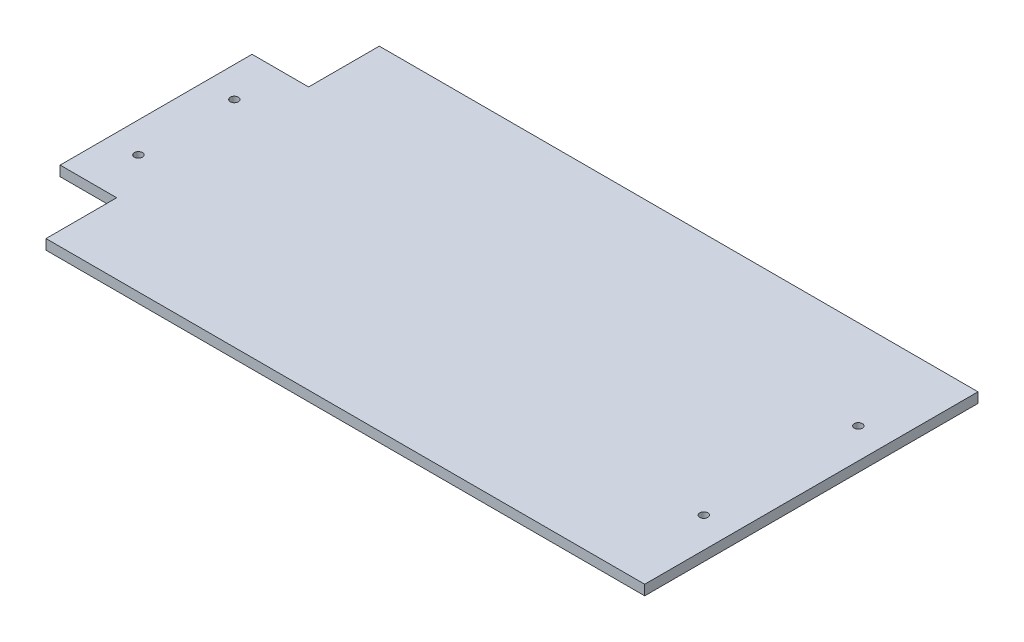
ISO-10303-21;
HEADER;
FILE_DESCRIPTION(('STEP AP214'),'2;1');
FILE_NAME('part.step','',(''),(''),'','','');
FILE_SCHEMA(('AUTOMOTIVE_DESIGN { 1 0 10303 214 1 1 1 1 }'));
ENDSEC;
DATA;
#1=APPLICATION_CONTEXT('core data for automotive mechanical design processes');
#2=APPLICATION_PROTOCOL_DEFINITION('international standard','automotive_design',2000,#1);
#3=PRODUCT_CONTEXT('',#1,'mechanical');
#4=PRODUCT('Part','Part','',(#3));
#5=PRODUCT_RELATED_PRODUCT_CATEGORY('part','',(#4));
#6=PRODUCT_DEFINITION_FORMATION('','',#4);
#7=PRODUCT_DEFINITION_CONTEXT('part definition',#1,'design');
#8=PRODUCT_DEFINITION('design','',#6,#7);
#9=PRODUCT_DEFINITION_SHAPE('','',#8);
#10=(LENGTH_UNIT() NAMED_UNIT(*) SI_UNIT(.MILLI.,.METRE.));
#11=(NAMED_UNIT(*) PLANE_ANGLE_UNIT() SI_UNIT($,.RADIAN.));
#12=(NAMED_UNIT(*) SI_UNIT($,.STERADIAN.) SOLID_ANGLE_UNIT());
#13=UNCERTAINTY_MEASURE_WITH_UNIT(LENGTH_MEASURE(1.E-05),#10,'distance_accuracy_value','');
#14=(GEOMETRIC_REPRESENTATION_CONTEXT(3) GLOBAL_UNCERTAINTY_ASSIGNED_CONTEXT((#13)) GLOBAL_UNIT_ASSIGNED_CONTEXT((#10,
#11,#12)) REPRESENTATION_CONTEXT('',''));
#15=CARTESIAN_POINT('',(0.,0.,0.));
#16=DIRECTION('',(0.,0.,1.));
#17=DIRECTION('',(1.,0.,0.));
#18=AXIS2_PLACEMENT_3D('',#15,#16,#17);
#19=CARTESIAN_POINT('',(162.2,5.,-82.5000000000001));
#20=DIRECTION('',(0.,0.,1.));
#21=DIRECTION('',(1.,0.,0.));
#22=AXIS2_PLACEMENT_3D('',#19,#20,#21);
#23=PLANE('',#22);
#24=DIRECTION('',(-1.,0.,0.));
#25=VECTOR('',#24,1.);
#26=CARTESIAN_POINT('',(162.2,0.,-82.5000000000001));
#27=LINE('',#26,#25);
#28=CARTESIAN_POINT('',(162.2,0.,-82.5000000000001));
#29=VERTEX_POINT('',#28);
#30=CARTESIAN_POINT('',(-134.2,0.,-82.5));
#31=VERTEX_POINT('',#30);
#32=EDGE_CURVE('E148',#29,#31,#27,.T.);
#33=ORIENTED_EDGE('',*,*,#32,.T.);
#34=DIRECTION('',(0.,-1.,0.));
#35=VECTOR('',#34,1.);
#36=CARTESIAN_POINT('',(-134.2,5.,-82.5));
#37=LINE('',#36,#35);
#38=CARTESIAN_POINT('',(-134.2,5.,-82.5));
#39=VERTEX_POINT('',#38);
#40=EDGE_CURVE('E11',#39,#31,#37,.T.);
#41=ORIENTED_EDGE('',*,*,#40,.F.);
#42=DIRECTION('',(-1.,0.,0.));
#43=VECTOR('',#42,1.);
#44=CARTESIAN_POINT('',(162.2,5.,-82.5000000000001));
#45=LINE('',#44,#43);
#46=CARTESIAN_POINT('',(162.2,5.,-82.5000000000001));
#47=VERTEX_POINT('',#46);
#48=EDGE_CURVE('E171',#47,#39,#45,.T.);
#49=ORIENTED_EDGE('',*,*,#48,.F.);
#50=DIRECTION('',(0.,-1.,0.));
#51=VECTOR('',#50,1.);
#52=CARTESIAN_POINT('',(162.2,5.,-82.5000000000001));
#53=LINE('',#52,#51);
#54=EDGE_CURVE('E144',#47,#29,#53,.T.);
#55=ORIENTED_EDGE('',*,*,#54,.T.);
#56=EDGE_LOOP('',(#33,#41,#49,#55));
#57=FACE_BOUND('',#56,.T.);
#58=ADVANCED_FACE('F47',(#57),#23,.F.);
#59=CARTESIAN_POINT('',(-134.2,5.,-47.5));
#60=DIRECTION('',(1.,0.,0.));
#61=DIRECTION('',(0.,0.,-1.));
#62=AXIS2_PLACEMENT_3D('',#59,#60,#61);
#63=PLANE('',#62);
#64=DIRECTION('',(0.,0.,1.));
#65=VECTOR('',#64,1.);
#66=CARTESIAN_POINT('',(-134.2,0.,-47.5));
#67=LINE('',#66,#65);
#68=CARTESIAN_POINT('',(-134.2,0.,-47.5));
#69=VERTEX_POINT('',#68);
#70=EDGE_CURVE('E152',#31,#69,#67,.T.);
#71=ORIENTED_EDGE('',*,*,#70,.T.);
#72=DIRECTION('',(0.,-1.,0.));
#73=VECTOR('',#72,1.);
#74=CARTESIAN_POINT('',(-134.2,5.,-47.5));
#75=LINE('',#74,#73);
#76=CARTESIAN_POINT('',(-134.2,5.,-47.5));
#77=VERTEX_POINT('',#76);
#78=EDGE_CURVE('E56',#77,#69,#75,.T.);
#79=ORIENTED_EDGE('',*,*,#78,.F.);
#80=DIRECTION('',(0.,0.,1.));
#81=VECTOR('',#80,1.);
#82=CARTESIAN_POINT('',(-134.2,5.,-47.5));
#83=LINE('',#82,#81);
#84=EDGE_CURVE('E107',#39,#77,#83,.T.);
#85=ORIENTED_EDGE('',*,*,#84,.F.);
#86=ORIENTED_EDGE('',*,*,#40,.T.);
#87=EDGE_LOOP('',(#71,#79,#85,#86));
#88=FACE_BOUND('',#87,.T.);
#89=ADVANCED_FACE('F272',(#88),#63,.F.);
#90=CARTESIAN_POINT('',(-162.2,5.,-47.5));
#91=DIRECTION('',(0.,0.,1.));
#92=DIRECTION('',(1.,0.,0.));
#93=AXIS2_PLACEMENT_3D('',#90,#91,#92);
#94=PLANE('',#93);
#95=DIRECTION('',(-1.,0.,0.));
#96=VECTOR('',#95,1.);
#97=CARTESIAN_POINT('',(-162.2,0.,-47.5));
#98=LINE('',#97,#96);
#99=CARTESIAN_POINT('',(-162.2,0.,-47.5));
#100=VERTEX_POINT('',#99);
#101=EDGE_CURVE('E156',#69,#100,#98,.T.);
#102=ORIENTED_EDGE('',*,*,#101,.T.);
#103=DIRECTION('',(0.,-1.,0.));
#104=VECTOR('',#103,1.);
#105=CARTESIAN_POINT('',(-162.2,5.,-47.5));
#106=LINE('',#105,#104);
#107=CARTESIAN_POINT('',(-162.2,5.,-47.5));
#108=VERTEX_POINT('',#107);
#109=EDGE_CURVE('E182',#108,#100,#106,.T.);
#110=ORIENTED_EDGE('',*,*,#109,.F.);
#111=DIRECTION('',(-1.,0.,0.));
#112=VECTOR('',#111,1.);
#113=CARTESIAN_POINT('',(-162.2,5.,-47.5));
#114=LINE('',#113,#112);
#115=EDGE_CURVE('E192',#77,#108,#114,.T.);
#116=ORIENTED_EDGE('',*,*,#115,.F.);
#117=ORIENTED_EDGE('',*,*,#78,.T.);
#118=EDGE_LOOP('',(#102,#110,#116,#117));
#119=FACE_BOUND('',#118,.T.);
#120=ADVANCED_FACE('F190',(#119),#94,.F.);
#121=CARTESIAN_POINT('',(-162.2,5.,-47.5));
#122=DIRECTION('',(1.,0.,0.));
#123=DIRECTION('',(0.,0.,-1.));
#124=AXIS2_PLACEMENT_3D('',#121,#122,#123);
#125=PLANE('',#124);
#126=DIRECTION('',(0.,0.,1.));
#127=VECTOR('',#126,1.);
#128=CARTESIAN_POINT('',(-162.2,0.,-47.5));
#129=LINE('',#128,#127);
#130=CARTESIAN_POINT('',(-162.2,0.,47.5));
#131=VERTEX_POINT('',#130);
#132=EDGE_CURVE('E159',#100,#131,#129,.T.);
#133=ORIENTED_EDGE('',*,*,#132,.T.);
#134=DIRECTION('',(0.,-1.,0.));
#135=VECTOR('',#134,1.);
#136=CARTESIAN_POINT('',(-162.2,5.,47.5));
#137=LINE('',#136,#135);
#138=CARTESIAN_POINT('',(-162.2,5.,47.5));
#139=VERTEX_POINT('',#138);
#140=EDGE_CURVE('E178',#139,#131,#137,.T.);
#141=ORIENTED_EDGE('',*,*,#140,.F.);
#142=DIRECTION('',(0.,0.,1.));
#143=VECTOR('',#142,1.);
#144=CARTESIAN_POINT('',(-162.2,5.,-47.5));
#145=LINE('',#144,#143);
#146=EDGE_CURVE('E205',#108,#139,#145,.T.);
#147=ORIENTED_EDGE('',*,*,#146,.F.);
#148=ORIENTED_EDGE('',*,*,#109,.T.);
#149=EDGE_LOOP('',(#133,#141,#147,#148));
#150=FACE_BOUND('',#149,.T.);
#151=ADVANCED_FACE('F200',(#150),#125,.F.);
#152=CARTESIAN_POINT('',(-162.2,5.,47.5));
#153=DIRECTION('',(0.,0.,-1.));
#154=DIRECTION('',(-1.,0.,0.));
#155=AXIS2_PLACEMENT_3D('',#152,#153,#154);
#156=PLANE('',#155);
#157=DIRECTION('',(1.,0.,0.));
#158=VECTOR('',#157,1.);
#159=CARTESIAN_POINT('',(-162.2,0.,47.5));
#160=LINE('',#159,#158);
#161=CARTESIAN_POINT('',(-134.2,0.,47.5));
#162=VERTEX_POINT('',#161);
#163=EDGE_CURVE('E162',#131,#162,#160,.T.);
#164=ORIENTED_EDGE('',*,*,#163,.T.);
#165=DIRECTION('',(0.,-1.,0.));
#166=VECTOR('',#165,1.);
#167=CARTESIAN_POINT('',(-134.2,5.,47.5));
#168=LINE('',#167,#166);
#169=CARTESIAN_POINT('',(-134.2,5.,47.5));
#170=VERTEX_POINT('',#169);
#171=EDGE_CURVE('E137',#170,#162,#168,.T.);
#172=ORIENTED_EDGE('',*,*,#171,.F.);
#173=DIRECTION('',(1.,0.,0.));
#174=VECTOR('',#173,1.);
#175=CARTESIAN_POINT('',(-162.2,5.,47.5));
#176=LINE('',#175,#174);
#177=EDGE_CURVE('E126',#139,#170,#176,.T.);
#178=ORIENTED_EDGE('',*,*,#177,.F.);
#179=ORIENTED_EDGE('',*,*,#140,.T.);
#180=EDGE_LOOP('',(#164,#172,#178,#179));
#181=FACE_BOUND('',#180,.T.);
#182=ADVANCED_FACE('F203',(#181),#156,.F.);
#183=CARTESIAN_POINT('',(-134.2,5.,47.5));
#184=DIRECTION('',(1.,0.,0.));
#185=DIRECTION('',(0.,0.,-1.));
#186=AXIS2_PLACEMENT_3D('',#183,#184,#185);
#187=PLANE('',#186);
#188=DIRECTION('',(0.,0.,1.));
#189=VECTOR('',#188,1.);
#190=CARTESIAN_POINT('',(-134.2,0.,47.5));
#191=LINE('',#190,#189);
#192=CARTESIAN_POINT('',(-134.2,0.,82.5));
#193=VERTEX_POINT('',#192);
#194=EDGE_CURVE('E135',#162,#193,#191,.T.);
#195=ORIENTED_EDGE('',*,*,#194,.T.);
#196=DIRECTION('',(0.,-1.,0.));
#197=VECTOR('',#196,1.);
#198=CARTESIAN_POINT('',(-134.2,5.,82.5));
#199=LINE('',#198,#197);
#200=CARTESIAN_POINT('',(-134.2,5.,82.5));
#201=VERTEX_POINT('',#200);
#202=EDGE_CURVE('E132',#201,#193,#199,.T.);
#203=ORIENTED_EDGE('',*,*,#202,.F.);
#204=DIRECTION('',(0.,0.,1.));
#205=VECTOR('',#204,1.);
#206=CARTESIAN_POINT('',(-134.2,5.,47.5));
#207=LINE('',#206,#205);
#208=EDGE_CURVE('E120',#170,#201,#207,.T.);
#209=ORIENTED_EDGE('',*,*,#208,.F.);
#210=ORIENTED_EDGE('',*,*,#171,.T.);
#211=EDGE_LOOP('',(#195,#203,#209,#210));
#212=FACE_BOUND('',#211,.T.);
#213=ADVANCED_FACE('F133',(#212),#187,.F.);
#214=CARTESIAN_POINT('',(162.2,5.,82.5000000000001));
#215=DIRECTION('',(0.,0.,-1.));
#216=DIRECTION('',(-1.,0.,0.));
#217=AXIS2_PLACEMENT_3D('',#214,#215,#216);
#218=PLANE('',#217);
#219=DIRECTION('',(1.,0.,0.));
#220=VECTOR('',#219,1.);
#221=CARTESIAN_POINT('',(162.2,0.,82.5000000000001));
#222=LINE('',#221,#220);
#223=CARTESIAN_POINT('',(162.2,0.,82.5000000000001));
#224=VERTEX_POINT('',#223);
#225=EDGE_CURVE('E93',#193,#224,#222,.T.);
#226=ORIENTED_EDGE('',*,*,#225,.T.);
#227=DIRECTION('',(0.,-1.,0.));
#228=VECTOR('',#227,1.);
#229=CARTESIAN_POINT('',(162.2,5.,82.5000000000001));
#230=LINE('',#229,#228);
#231=CARTESIAN_POINT('',(162.2,5.,82.5000000000001));
#232=VERTEX_POINT('',#231);
#233=EDGE_CURVE('E138',#232,#224,#230,.T.);
#234=ORIENTED_EDGE('',*,*,#233,.F.);
#235=DIRECTION('',(1.,0.,0.));
#236=VECTOR('',#235,1.);
#237=CARTESIAN_POINT('',(162.2,5.,82.5000000000001));
#238=LINE('',#237,#236);
#239=EDGE_CURVE('E124',#201,#232,#238,.T.);
#240=ORIENTED_EDGE('',*,*,#239,.F.);
#241=ORIENTED_EDGE('',*,*,#202,.T.);
#242=EDGE_LOOP('',(#226,#234,#240,#241));
#243=FACE_BOUND('',#242,.T.);
#244=ADVANCED_FACE('F140',(#243),#218,.F.);
#245=CARTESIAN_POINT('',(162.2,5.,82.5000000000001));
#246=DIRECTION('',(-1.,0.,0.));
#247=DIRECTION('',(0.,0.,1.));
#248=AXIS2_PLACEMENT_3D('',#245,#246,#247);
#249=PLANE('',#248);
#250=DIRECTION('',(0.,0.,-1.));
#251=VECTOR('',#250,1.);
#252=CARTESIAN_POINT('',(162.2,0.,82.5000000000001));
#253=LINE('',#252,#251);
#254=EDGE_CURVE('E99',#224,#29,#253,.T.);
#255=ORIENTED_EDGE('',*,*,#254,.T.);
#256=ORIENTED_EDGE('',*,*,#54,.F.);
#257=DIRECTION('',(0.,0.,-1.));
#258=VECTOR('',#257,1.);
#259=CARTESIAN_POINT('',(162.2,5.,82.5000000000001));
#260=LINE('',#259,#258);
#261=EDGE_CURVE('E64',#232,#47,#260,.T.);
#262=ORIENTED_EDGE('',*,*,#261,.F.);
#263=ORIENTED_EDGE('',*,*,#233,.T.);
#264=EDGE_LOOP('',(#255,#256,#262,#263));
#265=FACE_BOUND('',#264,.T.);
#266=ADVANCED_FACE('F251',(#265),#249,.F.);
#267=CARTESIAN_POINT('',(0.,5.,0.));
#268=DIRECTION('',(0.,-1.,0.));
#269=DIRECTION('',(0.,0.,-1.));
#270=AXIS2_PLACEMENT_3D('',#267,#268,#269);
#271=PLANE('',#270);
#272=CARTESIAN_POINT('',(-147.2,5.,23.75));
#273=DIRECTION('',(0.,1.,0.));
#274=DIRECTION('',(0.,0.,-1.));
#275=AXIS2_PLACEMENT_3D('',#272,#273,#274);
#276=CIRCLE('',#275,2.);
#277=CARTESIAN_POINT('',(-147.2,5.,21.75));
#278=VERTEX_POINT('',#277);
#279=EDGE_CURVE('E227',#278,#278,#276,.T.);
#280=ORIENTED_EDGE('',*,*,#279,.F.);
#281=EDGE_LOOP('',(#280));
#282=FACE_BOUND('',#281,.T.);
#283=CARTESIAN_POINT('',(147.2,5.,38.2500000000001));
#284=DIRECTION('',(0.,1.,0.));
#285=DIRECTION('',(0.,0.,-1.));
#286=AXIS2_PLACEMENT_3D('',#283,#284,#285);
#287=CIRCLE('',#286,2.);
#288=CARTESIAN_POINT('',(147.2,5.,36.2500000000001));
#289=VERTEX_POINT('',#288);
#290=EDGE_CURVE('E235',#289,#289,#287,.T.);
#291=ORIENTED_EDGE('',*,*,#290,.F.);
#292=EDGE_LOOP('',(#291));
#293=FACE_BOUND('',#292,.T.);
#294=CARTESIAN_POINT('',(147.2,5.,-38.2500000000001));
#295=DIRECTION('',(0.,1.,0.));
#296=DIRECTION('',(0.,0.,1.));
#297=AXIS2_PLACEMENT_3D('',#294,#295,#296);
#298=CIRCLE('',#297,2.);
#299=CARTESIAN_POINT('',(147.2,5.,-36.2500000000001));
#300=VERTEX_POINT('',#299);
#301=EDGE_CURVE('E219',#300,#300,#298,.T.);
#302=ORIENTED_EDGE('',*,*,#301,.F.);
#303=EDGE_LOOP('',(#302));
#304=FACE_BOUND('',#303,.T.);
#305=CARTESIAN_POINT('',(-147.2,5.,-23.75));
#306=DIRECTION('',(0.,1.,0.));
#307=DIRECTION('',(0.,0.,1.));
#308=AXIS2_PLACEMENT_3D('',#305,#306,#307);
#309=CIRCLE('',#308,2.);
#310=CARTESIAN_POINT('',(-147.2,5.,-21.75));
#311=VERTEX_POINT('',#310);
#312=EDGE_CURVE('E215',#311,#311,#309,.T.);
#313=ORIENTED_EDGE('',*,*,#312,.F.);
#314=EDGE_LOOP('',(#313));
#315=FACE_BOUND('',#314,.T.);
#316=ORIENTED_EDGE('',*,*,#48,.T.);
#317=ORIENTED_EDGE('',*,*,#84,.T.);
#318=ORIENTED_EDGE('',*,*,#115,.T.);
#319=ORIENTED_EDGE('',*,*,#146,.T.);
#320=ORIENTED_EDGE('',*,*,#177,.T.);
#321=ORIENTED_EDGE('',*,*,#208,.T.);
#322=ORIENTED_EDGE('',*,*,#239,.T.);
#323=ORIENTED_EDGE('',*,*,#261,.T.);
#324=EDGE_LOOP('',(#316,#317,#318,#319,#320,#321,#322,#323));
#325=FACE_BOUND('',#324,.T.);
#326=ADVANCED_FACE('F122',(#282,#293,#304,#315,#325),#271,.F.);
#327=CARTESIAN_POINT('',(0.,0.,0.));
#328=DIRECTION('',(0.,-1.,0.));
#329=DIRECTION('',(0.,0.,-1.));
#330=AXIS2_PLACEMENT_3D('',#327,#328,#329);
#331=PLANE('',#330);
#332=CARTESIAN_POINT('',(-147.2,0.,23.75));
#333=DIRECTION('',(0.,1.,0.));
#334=DIRECTION('',(0.,0.,-1.));
#335=AXIS2_PLACEMENT_3D('',#332,#333,#334);
#336=CIRCLE('',#335,2.);
#337=CARTESIAN_POINT('',(-147.2,0.,21.75));
#338=VERTEX_POINT('',#337);
#339=EDGE_CURVE('E223',#338,#338,#336,.T.);
#340=ORIENTED_EDGE('',*,*,#339,.T.);
#341=EDGE_LOOP('',(#340));
#342=FACE_BOUND('',#341,.T.);
#343=CARTESIAN_POINT('',(147.2,0.,38.2500000000001));
#344=DIRECTION('',(0.,1.,0.));
#345=DIRECTION('',(0.,0.,-1.));
#346=AXIS2_PLACEMENT_3D('',#343,#344,#345);
#347=CIRCLE('',#346,2.);
#348=CARTESIAN_POINT('',(147.2,0.,36.2500000000001));
#349=VERTEX_POINT('',#348);
#350=EDGE_CURVE('E231',#349,#349,#347,.T.);
#351=ORIENTED_EDGE('',*,*,#350,.T.);
#352=EDGE_LOOP('',(#351));
#353=FACE_BOUND('',#352,.T.);
#354=CARTESIAN_POINT('',(147.2,0.,-38.2500000000001));
#355=DIRECTION('',(0.,1.,0.));
#356=DIRECTION('',(0.,0.,1.));
#357=AXIS2_PLACEMENT_3D('',#354,#355,#356);
#358=CIRCLE('',#357,2.);
#359=CARTESIAN_POINT('',(147.2,0.,-36.2500000000001));
#360=VERTEX_POINT('',#359);
#361=EDGE_CURVE('E239',#360,#360,#358,.T.);
#362=ORIENTED_EDGE('',*,*,#361,.T.);
#363=EDGE_LOOP('',(#362));
#364=FACE_BOUND('',#363,.T.);
#365=CARTESIAN_POINT('',(-147.2,0.,-23.75));
#366=DIRECTION('',(0.,1.,0.));
#367=DIRECTION('',(0.,0.,1.));
#368=AXIS2_PLACEMENT_3D('',#365,#366,#367);
#369=CIRCLE('',#368,2.);
#370=CARTESIAN_POINT('',(-147.2,0.,-21.75));
#371=VERTEX_POINT('',#370);
#372=EDGE_CURVE('E153',#371,#371,#369,.T.);
#373=ORIENTED_EDGE('',*,*,#372,.T.);
#374=EDGE_LOOP('',(#373));
#375=FACE_BOUND('',#374,.T.);
#376=ORIENTED_EDGE('',*,*,#32,.F.);
#377=ORIENTED_EDGE('',*,*,#254,.F.);
#378=ORIENTED_EDGE('',*,*,#225,.F.);
#379=ORIENTED_EDGE('',*,*,#194,.F.);
#380=ORIENTED_EDGE('',*,*,#163,.F.);
#381=ORIENTED_EDGE('',*,*,#132,.F.);
#382=ORIENTED_EDGE('',*,*,#101,.F.);
#383=ORIENTED_EDGE('',*,*,#70,.F.);
#384=EDGE_LOOP('',(#376,#377,#378,#379,#380,#381,#382,#383));
#385=FACE_BOUND('',#384,.T.);
#386=ADVANCED_FACE('F196',(#342,#353,#364,#375,#385),#331,.T.);
#387=CARTESIAN_POINT('',(-147.2,0.,-23.75));
#388=DIRECTION('',(0.,1.,0.));
#389=DIRECTION('',(0.,0.,1.));
#390=AXIS2_PLACEMENT_3D('',#387,#388,#389);
#391=CYLINDRICAL_SURFACE('',#390,2.);
#392=ORIENTED_EDGE('',*,*,#372,.F.);
#393=EDGE_LOOP('',(#392));
#394=FACE_BOUND('',#393,.T.);
#395=ORIENTED_EDGE('',*,*,#312,.T.);
#396=EDGE_LOOP('',(#395));
#397=FACE_BOUND('',#396,.T.);
#398=ADVANCED_FACE('F256',(#394,#397),#391,.F.);
#399=CARTESIAN_POINT('',(147.2,0.,-38.2500000000001));
#400=DIRECTION('',(0.,1.,0.));
#401=DIRECTION('',(0.,0.,1.));
#402=AXIS2_PLACEMENT_3D('',#399,#400,#401);
#403=CYLINDRICAL_SURFACE('',#402,2.);
#404=ORIENTED_EDGE('',*,*,#361,.F.);
#405=EDGE_LOOP('',(#404));
#406=FACE_BOUND('',#405,.T.);
#407=ORIENTED_EDGE('',*,*,#301,.T.);
#408=EDGE_LOOP('',(#407));
#409=FACE_BOUND('',#408,.T.);
#410=ADVANCED_FACE('F247',(#406,#409),#403,.F.);
#411=CARTESIAN_POINT('',(147.2,0.,38.2500000000001));
#412=DIRECTION('',(0.,1.,0.));
#413=DIRECTION('',(0.,0.,1.));
#414=AXIS2_PLACEMENT_3D('',#411,#412,#413);
#415=CYLINDRICAL_SURFACE('',#414,2.);
#416=ORIENTED_EDGE('',*,*,#350,.F.);
#417=EDGE_LOOP('',(#416));
#418=FACE_BOUND('',#417,.T.);
#419=ORIENTED_EDGE('',*,*,#290,.T.);
#420=EDGE_LOOP('',(#419));
#421=FACE_BOUND('',#420,.T.);
#422=ADVANCED_FACE('F264',(#418,#421),#415,.F.);
#423=CARTESIAN_POINT('',(-147.2,0.,23.75));
#424=DIRECTION('',(0.,1.,0.));
#425=DIRECTION('',(0.,0.,1.));
#426=AXIS2_PLACEMENT_3D('',#423,#424,#425);
#427=CYLINDRICAL_SURFACE('',#426,2.);
#428=ORIENTED_EDGE('',*,*,#339,.F.);
#429=EDGE_LOOP('',(#428));
#430=FACE_BOUND('',#429,.T.);
#431=ORIENTED_EDGE('',*,*,#279,.T.);
#432=EDGE_LOOP('',(#431));
#433=FACE_BOUND('',#432,.T.);
#434=ADVANCED_FACE('F353',(#430,#433),#427,.F.);
#435=CLOSED_SHELL('',(#58,#89,#120,#151,#182,#213,#244,#266,#326,#386,#398,#410,#422,#434));
#436=MANIFOLD_SOLID_BREP('B2',#435);
#437=ADVANCED_BREP_SHAPE_REPRESENTATION('',(#18,#436),#14);
#438=SHAPE_DEFINITION_REPRESENTATION(#9,#437);
ENDSEC;
END-ISO-10303-21;
